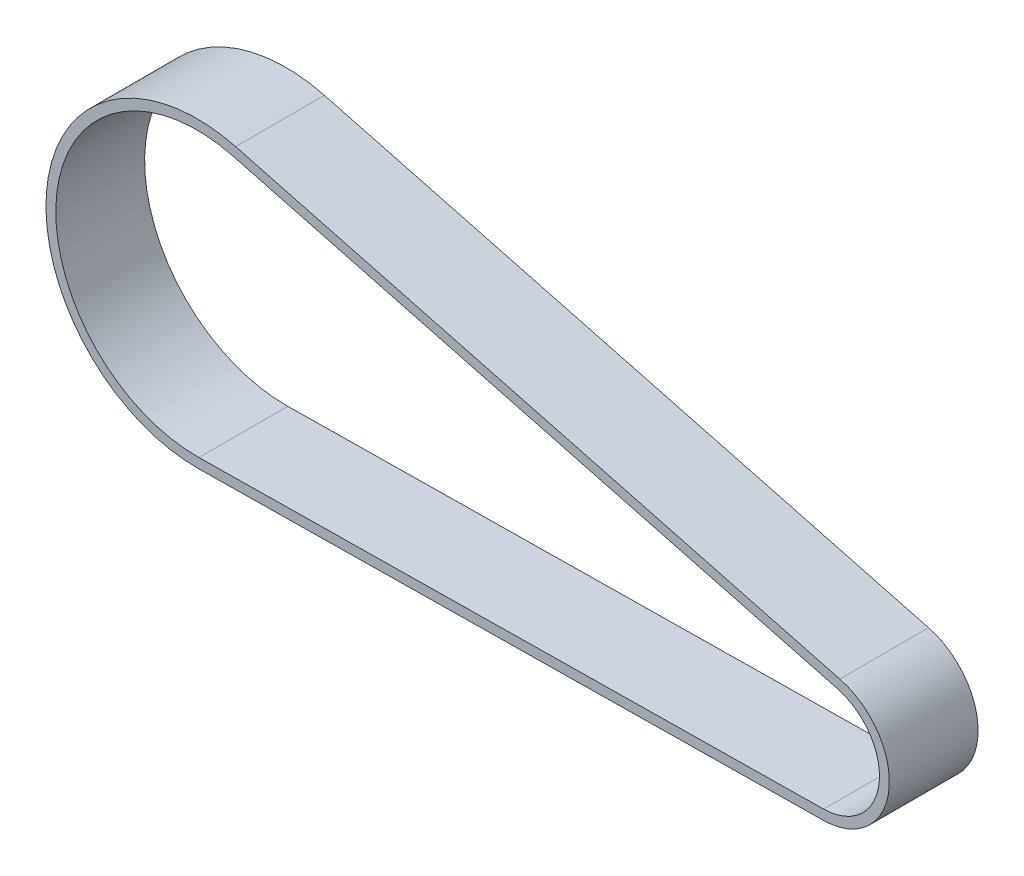
ISO-10303-21;
HEADER;
FILE_DESCRIPTION(('STEP AP214'),'2;1');
FILE_NAME('part.step','',(''),(''),'','','');
FILE_SCHEMA(('AUTOMOTIVE_DESIGN { 1 0 10303 214 1 1 1 1 }'));
ENDSEC;
DATA;
#1=APPLICATION_CONTEXT('core data for automotive mechanical design processes');
#2=APPLICATION_PROTOCOL_DEFINITION('international standard','automotive_design',2000,#1);
#3=PRODUCT_CONTEXT('',#1,'mechanical');
#4=PRODUCT('Part','Part','',(#3));
#5=PRODUCT_RELATED_PRODUCT_CATEGORY('part','',(#4));
#6=PRODUCT_DEFINITION_FORMATION('','',#4);
#7=PRODUCT_DEFINITION_CONTEXT('part definition',#1,'design');
#8=PRODUCT_DEFINITION('design','',#6,#7);
#9=PRODUCT_DEFINITION_SHAPE('','',#8);
#10=(LENGTH_UNIT() NAMED_UNIT(*) SI_UNIT(.MILLI.,.METRE.));
#11=(NAMED_UNIT(*) PLANE_ANGLE_UNIT() SI_UNIT($,.RADIAN.));
#12=(NAMED_UNIT(*) SI_UNIT($,.STERADIAN.) SOLID_ANGLE_UNIT());
#13=UNCERTAINTY_MEASURE_WITH_UNIT(LENGTH_MEASURE(1.E-05),#10,'distance_accuracy_value','');
#14=(GEOMETRIC_REPRESENTATION_CONTEXT(3) GLOBAL_UNCERTAINTY_ASSIGNED_CONTEXT((#13)) GLOBAL_UNIT_ASSIGNED_CONTEXT((#10,
#11,#12)) REPRESENTATION_CONTEXT('',''));
#15=CARTESIAN_POINT('',(0.,0.,0.));
#16=DIRECTION('',(0.,0.,1.));
#17=DIRECTION('',(1.,0.,0.));
#18=AXIS2_PLACEMENT_3D('',#15,#16,#17);
#19=CARTESIAN_POINT('',(0.,0.,-4.5));
#20=DIRECTION('',(0.,0.,1.));
#21=DIRECTION('',(1.,0.,0.));
#22=AXIS2_PLACEMENT_3D('',#19,#20,#21);
#23=CYLINDRICAL_SURFACE('',#22,6.73);
#24=DIRECTION('',(0.,0.,1.));
#25=VECTOR('',#24,1.);
#26=CARTESIAN_POINT('',(1.71271445503276,6.50841833286105,-4.5));
#27=LINE('',#26,#25);
#28=CARTESIAN_POINT('',(1.71271445503276,6.50841833286105,-4.5));
#29=VERTEX_POINT('',#28);
#30=CARTESIAN_POINT('',(1.71271445503276,6.50841833286105,4.5));
#31=VERTEX_POINT('',#30);
#32=EDGE_CURVE('E84',#29,#31,#27,.T.);
#33=ORIENTED_EDGE('',*,*,#32,.T.);
#34=CARTESIAN_POINT('',(0.,0.,4.5));
#35=DIRECTION('',(0.,0.,-1.));
#36=DIRECTION('',(-1.,0.,0.));
#37=AXIS2_PLACEMENT_3D('',#34,#35,#36);
#38=CIRCLE('',#37,6.73);
#39=CARTESIAN_POINT('',(0.0849420551690539,-6.72946393461349,4.5));
#40=VERTEX_POINT('',#39);
#41=EDGE_CURVE('E176',#40,#31,#38,.F.);
#42=ORIENTED_EDGE('',*,*,#41,.F.);
#43=DIRECTION('',(0.,0.,1.));
#44=VECTOR('',#43,1.);
#45=CARTESIAN_POINT('',(0.0849420551690539,-6.72946393461349,-4.5));
#46=LINE('',#45,#44);
#47=CARTESIAN_POINT('',(0.0849420551690539,-6.72946393461349,-4.5));
#48=VERTEX_POINT('',#47);
#49=EDGE_CURVE('E12',#48,#40,#46,.T.);
#50=ORIENTED_EDGE('',*,*,#49,.F.);
#51=CARTESIAN_POINT('',(0.,0.,-4.5));
#52=DIRECTION('',(0.,0.,-1.));
#53=DIRECTION('',(-1.,0.,0.));
#54=AXIS2_PLACEMENT_3D('',#51,#52,#53);
#55=CIRCLE('',#54,6.73);
#56=EDGE_CURVE('E195',#48,#29,#55,.F.);
#57=ORIENTED_EDGE('',*,*,#56,.T.);
#58=EDGE_LOOP('',(#33,#42,#50,#57));
#59=FACE_BOUND('',#58,.T.);
#60=ADVANCED_FACE('F81',(#59),#23,.T.);
#61=CARTESIAN_POINT('',(0.084942055169054,-6.72946393461349,-4.5));
#62=DIRECTION('',(0.012621404928537,-0.999920346896506,0.));
#63=DIRECTION('',(0.999920346896507,0.012621404928537,0.));
#64=AXIS2_PLACEMENT_3D('',#61,#62,#63);
#65=PLANE('',#64);
#66=ORIENTED_EDGE('',*,*,#49,.T.);
#67=DIRECTION('',(0.999920346896507,0.012621404928537,0.));
#68=VECTOR('',#67,1.);
#69=CARTESIAN_POINT('',(0.084942055169054,-6.72946393461349,4.5));
#70=LINE('',#69,#68);
#71=CARTESIAN_POINT('',(-63.2401251553675,-7.52877891792358,4.5));
#72=VERTEX_POINT('',#71);
#73=EDGE_CURVE('E185',#72,#40,#70,.T.);
#74=ORIENTED_EDGE('',*,*,#73,.F.);
#75=DIRECTION('',(0.,0.,1.));
#76=VECTOR('',#75,1.);
#77=CARTESIAN_POINT('',(-63.2401251553675,-7.52877891792358,-4.5));
#78=LINE('',#77,#76);
#79=CARTESIAN_POINT('',(-63.2401251553675,-7.52877891792358,-4.5));
#80=VERTEX_POINT('',#79);
#81=EDGE_CURVE('E89',#80,#72,#78,.T.);
#82=ORIENTED_EDGE('',*,*,#81,.F.);
#83=DIRECTION('',(0.999920346896507,0.012621404928537,0.));
#84=VECTOR('',#83,1.);
#85=CARTESIAN_POINT('',(0.084942055169054,-6.72946393461349,-4.5));
#86=LINE('',#85,#84);
#87=EDGE_CURVE('E206',#80,#48,#86,.T.);
#88=ORIENTED_EDGE('',*,*,#87,.T.);
#89=EDGE_LOOP('',(#66,#74,#82,#88));
#90=FACE_BOUND('',#89,.T.);
#91=ADVANCED_FACE('F218',(#90),#65,.T.);
#92=CARTESIAN_POINT('',(-63.433611292922,7.79999999999986,-4.5));
#93=DIRECTION('',(0.,0.,1.));
#94=DIRECTION('',(1.,0.,0.));
#95=AXIS2_PLACEMENT_3D('',#92,#93,#94);
#96=CYLINDRICAL_SURFACE('',#95,15.33);
#97=ORIENTED_EDGE('',*,*,#81,.T.);
#98=CARTESIAN_POINT('',(-63.433611292922,7.79999999999986,4.5));
#99=DIRECTION('',(0.,0.,-1.));
#100=DIRECTION('',(-1.,0.,0.));
#101=AXIS2_PLACEMENT_3D('',#98,#99,#100);
#102=CIRCLE('',#101,15.33);
#103=CARTESIAN_POINT('',(-59.5322869845041,22.6252679112569,4.5));
#104=VERTEX_POINT('',#103);
#105=EDGE_CURVE('E182',#104,#72,#102,.F.);
#106=ORIENTED_EDGE('',*,*,#105,.F.);
#107=DIRECTION('',(0.,0.,1.));
#108=VECTOR('',#107,1.);
#109=CARTESIAN_POINT('',(-59.5322869845041,22.6252679112569,-4.5));
#110=LINE('',#109,#108);
#111=CARTESIAN_POINT('',(-59.5322869845041,22.6252679112569,-4.5));
#112=VERTEX_POINT('',#111);
#113=EDGE_CURVE('E209',#112,#104,#110,.T.);
#114=ORIENTED_EDGE('',*,*,#113,.F.);
#115=CARTESIAN_POINT('',(-63.433611292922,7.79999999999986,-4.5));
#116=DIRECTION('',(0.,0.,-1.));
#117=DIRECTION('',(-1.,0.,0.));
#118=AXIS2_PLACEMENT_3D('',#115,#116,#117);
#119=CIRCLE('',#118,15.33);
#120=EDGE_CURVE('E203',#112,#80,#119,.F.);
#121=ORIENTED_EDGE('',*,*,#120,.T.);
#122=EDGE_LOOP('',(#97,#106,#114,#121));
#123=FACE_BOUND('',#122,.T.);
#124=ADVANCED_FACE('F224',(#123),#96,.T.);
#125=CARTESIAN_POINT('',(1.71271445503274,6.50841833286106,-4.5));
#126=DIRECTION('',(0.254489517835474,0.967075532371628,0.));
#127=DIRECTION('',(-0.967075532371628,0.254489517835474,0.));
#128=AXIS2_PLACEMENT_3D('',#125,#126,#127);
#129=PLANE('',#128);
#130=ORIENTED_EDGE('',*,*,#113,.T.);
#131=DIRECTION('',(-0.967075532371628,0.254489517835474,0.));
#132=VECTOR('',#131,1.);
#133=CARTESIAN_POINT('',(1.71271445503274,6.50841833286106,4.5));
#134=LINE('',#133,#132);
#135=EDGE_CURVE('E179',#31,#104,#134,.T.);
#136=ORIENTED_EDGE('',*,*,#135,.F.);
#137=ORIENTED_EDGE('',*,*,#32,.F.);
#138=DIRECTION('',(-0.967075532371628,0.254489517835474,0.));
#139=VECTOR('',#138,1.);
#140=CARTESIAN_POINT('',(1.71271445503274,6.50841833286106,-4.5));
#141=LINE('',#140,#139);
#142=EDGE_CURVE('E200',#29,#112,#141,.T.);
#143=ORIENTED_EDGE('',*,*,#142,.T.);
#144=EDGE_LOOP('',(#130,#136,#137,#143));
#145=FACE_BOUND('',#144,.T.);
#146=ADVANCED_FACE('F213',(#145),#129,.T.);
#147=CARTESIAN_POINT('',(0.,0.,-4.5));
#148=DIRECTION('',(0.,0.,-1.));
#149=DIRECTION('',(-1.,0.,0.));
#150=AXIS2_PLACEMENT_3D('',#147,#148,#149);
#151=PLANE('',#150);
#152=CARTESIAN_POINT('',(0.,0.,-4.5));
#153=DIRECTION('',(0.,0.,1.));
#154=DIRECTION('',(-1.,0.,0.));
#155=AXIS2_PLACEMENT_3D('',#152,#153,#154);
#156=CIRCLE('',#155,5.73);
#157=CARTESIAN_POINT('',(0.0723206502405169,-5.72954358771698,-4.5));
#158=VERTEX_POINT('',#157);
#159=CARTESIAN_POINT('',(1.45822493719726,5.54134280048943,-4.5));
#160=VERTEX_POINT('',#159);
#161=EDGE_CURVE('E188',#158,#160,#156,.T.);
#162=ORIENTED_EDGE('',*,*,#161,.T.);
#163=DIRECTION('',(-0.967075532371628,0.254489517835474,0.));
#164=VECTOR('',#163,1.);
#165=CARTESIAN_POINT('',(-59.7867765023396,21.6581923788853,-4.5));
#166=LINE('',#165,#164);
#167=CARTESIAN_POINT('',(-59.7867765023396,21.6581923788853,-4.5));
#168=VERTEX_POINT('',#167);
#169=EDGE_CURVE('E153',#160,#168,#166,.T.);
#170=ORIENTED_EDGE('',*,*,#169,.T.);
#171=CARTESIAN_POINT('',(-63.433611292922,7.79999999999986,-4.5));
#172=DIRECTION('',(0.,0.,1.));
#173=DIRECTION('',(-1.,0.,0.));
#174=AXIS2_PLACEMENT_3D('',#171,#172,#173);
#175=CIRCLE('',#174,14.33);
#176=CARTESIAN_POINT('',(-63.252746560296,-6.52885857102708,-4.5));
#177=VERTEX_POINT('',#176);
#178=EDGE_CURVE('E97',#168,#177,#175,.T.);
#179=ORIENTED_EDGE('',*,*,#178,.T.);
#180=DIRECTION('',(0.999920346896506,0.012621404928537,0.));
#181=VECTOR('',#180,1.);
#182=CARTESIAN_POINT('',(0.0723206502405169,-5.72954358771698,-4.5));
#183=LINE('',#182,#181);
#184=EDGE_CURVE('E158',#177,#158,#183,.T.);
#185=ORIENTED_EDGE('',*,*,#184,.T.);
#186=EDGE_LOOP('',(#162,#170,#179,#185));
#187=FACE_BOUND('',#186,.T.);
#188=ORIENTED_EDGE('',*,*,#56,.F.);
#189=ORIENTED_EDGE('',*,*,#87,.F.);
#190=ORIENTED_EDGE('',*,*,#120,.F.);
#191=ORIENTED_EDGE('',*,*,#142,.F.);
#192=EDGE_LOOP('',(#188,#189,#190,#191));
#193=FACE_BOUND('',#192,.T.);
#194=ADVANCED_FACE('F222',(#187,#193),#151,.T.);
#195=CARTESIAN_POINT('',(0.,0.,-4.5));
#196=DIRECTION('',(0.,0.,1.));
#197=DIRECTION('',(1.,0.,0.));
#198=AXIS2_PLACEMENT_3D('',#195,#196,#197);
#199=CYLINDRICAL_SURFACE('',#198,5.73);
#200=DIRECTION('',(0.,0.,1.));
#201=VECTOR('',#200,1.);
#202=CARTESIAN_POINT('',(0.0723206502405169,-5.72954358771698,-4.5));
#203=LINE('',#202,#201);
#204=CARTESIAN_POINT('',(0.0723206502405169,-5.72954358771698,4.5));
#205=VERTEX_POINT('',#204);
#206=EDGE_CURVE('E163',#158,#205,#203,.T.);
#207=ORIENTED_EDGE('',*,*,#206,.T.);
#208=CARTESIAN_POINT('',(0.,0.,4.5));
#209=DIRECTION('',(0.,0.,1.));
#210=DIRECTION('',(-1.,0.,0.));
#211=AXIS2_PLACEMENT_3D('',#208,#209,#210);
#212=CIRCLE('',#211,5.73);
#213=CARTESIAN_POINT('',(1.45822493719726,5.54134280048943,4.5));
#214=VERTEX_POINT('',#213);
#215=EDGE_CURVE('E161',#205,#214,#212,.T.);
#216=ORIENTED_EDGE('',*,*,#215,.T.);
#217=DIRECTION('',(0.,0.,1.));
#218=VECTOR('',#217,1.);
#219=CARTESIAN_POINT('',(1.45822493719726,5.54134280048943,-4.5));
#220=LINE('',#219,#218);
#221=EDGE_CURVE('E146',#160,#214,#220,.T.);
#222=ORIENTED_EDGE('',*,*,#221,.F.);
#223=ORIENTED_EDGE('',*,*,#161,.F.);
#224=EDGE_LOOP('',(#207,#216,#222,#223));
#225=FACE_BOUND('',#224,.T.);
#226=ADVANCED_FACE('F162',(#225),#199,.F.);
#227=CARTESIAN_POINT('',(0.0723206502405169,-5.72954358771698,-4.5));
#228=DIRECTION('',(0.012621404928537,-0.999920346896507,0.));
#229=DIRECTION('',(0.999920346896506,0.012621404928537,0.));
#230=AXIS2_PLACEMENT_3D('',#227,#228,#229);
#231=PLANE('',#230);
#232=DIRECTION('',(0.,0.,1.));
#233=VECTOR('',#232,1.);
#234=CARTESIAN_POINT('',(-63.252746560296,-6.52885857102708,-4.5));
#235=LINE('',#234,#233);
#236=CARTESIAN_POINT('',(-63.252746560296,-6.52885857102708,4.5));
#237=VERTEX_POINT('',#236);
#238=EDGE_CURVE('E196',#177,#237,#235,.T.);
#239=ORIENTED_EDGE('',*,*,#238,.T.);
#240=DIRECTION('',(0.999920346896506,0.012621404928537,0.));
#241=VECTOR('',#240,1.);
#242=CARTESIAN_POINT('',(0.0723206502405169,-5.72954358771698,4.5));
#243=LINE('',#242,#241);
#244=EDGE_CURVE('E172',#237,#205,#243,.T.);
#245=ORIENTED_EDGE('',*,*,#244,.T.);
#246=ORIENTED_EDGE('',*,*,#206,.F.);
#247=ORIENTED_EDGE('',*,*,#184,.F.);
#248=EDGE_LOOP('',(#239,#245,#246,#247));
#249=FACE_BOUND('',#248,.T.);
#250=ADVANCED_FACE('F267',(#249),#231,.F.);
#251=CARTESIAN_POINT('',(-63.433611292922,7.79999999999986,-4.5));
#252=DIRECTION('',(0.,0.,1.));
#253=DIRECTION('',(1.,0.,0.));
#254=AXIS2_PLACEMENT_3D('',#251,#252,#253);
#255=CYLINDRICAL_SURFACE('',#254,14.33);
#256=DIRECTION('',(0.,0.,1.));
#257=VECTOR('',#256,1.);
#258=CARTESIAN_POINT('',(-59.7867765023396,21.6581923788853,-4.5));
#259=LINE('',#258,#257);
#260=CARTESIAN_POINT('',(-59.7867765023396,21.6581923788853,4.5));
#261=VERTEX_POINT('',#260);
#262=EDGE_CURVE('E157',#168,#261,#259,.T.);
#263=ORIENTED_EDGE('',*,*,#262,.T.);
#264=CARTESIAN_POINT('',(-63.433611292922,7.79999999999986,4.5));
#265=DIRECTION('',(0.,0.,1.));
#266=DIRECTION('',(-1.,0.,0.));
#267=AXIS2_PLACEMENT_3D('',#264,#265,#266);
#268=CIRCLE('',#267,14.33);
#269=EDGE_CURVE('E170',#261,#237,#268,.T.);
#270=ORIENTED_EDGE('',*,*,#269,.T.);
#271=ORIENTED_EDGE('',*,*,#238,.F.);
#272=ORIENTED_EDGE('',*,*,#178,.F.);
#273=EDGE_LOOP('',(#263,#270,#271,#272));
#274=FACE_BOUND('',#273,.T.);
#275=ADVANCED_FACE('F276',(#274),#255,.F.);
#276=CARTESIAN_POINT('',(-59.7867765023396,21.6581923788853,-4.5));
#277=DIRECTION('',(0.254489517835474,0.967075532371628,0.));
#278=DIRECTION('',(-0.967075532371628,0.254489517835474,0.));
#279=AXIS2_PLACEMENT_3D('',#276,#277,#278);
#280=PLANE('',#279);
#281=ORIENTED_EDGE('',*,*,#221,.T.);
#282=DIRECTION('',(-0.967075532371628,0.254489517835474,0.));
#283=VECTOR('',#282,1.);
#284=CARTESIAN_POINT('',(-59.7867765023396,21.6581923788853,4.5));
#285=LINE('',#284,#283);
#286=EDGE_CURVE('E150',#214,#261,#285,.T.);
#287=ORIENTED_EDGE('',*,*,#286,.T.);
#288=ORIENTED_EDGE('',*,*,#262,.F.);
#289=ORIENTED_EDGE('',*,*,#169,.F.);
#290=EDGE_LOOP('',(#281,#287,#288,#289));
#291=FACE_BOUND('',#290,.T.);
#292=ADVANCED_FACE('F148',(#291),#280,.F.);
#293=CARTESIAN_POINT('',(0.,0.,4.5));
#294=DIRECTION('',(0.,0.,-1.));
#295=DIRECTION('',(-1.,0.,0.));
#296=AXIS2_PLACEMENT_3D('',#293,#294,#295);
#297=PLANE('',#296);
#298=ORIENTED_EDGE('',*,*,#41,.T.);
#299=ORIENTED_EDGE('',*,*,#135,.T.);
#300=ORIENTED_EDGE('',*,*,#105,.T.);
#301=ORIENTED_EDGE('',*,*,#73,.T.);
#302=EDGE_LOOP('',(#298,#299,#300,#301));
#303=FACE_BOUND('',#302,.T.);
#304=ORIENTED_EDGE('',*,*,#215,.F.);
#305=ORIENTED_EDGE('',*,*,#244,.F.);
#306=ORIENTED_EDGE('',*,*,#269,.F.);
#307=ORIENTED_EDGE('',*,*,#286,.F.);
#308=EDGE_LOOP('',(#304,#305,#306,#307));
#309=FACE_BOUND('',#308,.T.);
#310=ADVANCED_FACE('F168',(#303,#309),#297,.F.);
#311=CLOSED_SHELL('',(#60,#91,#124,#146,#194,#226,#250,#275,#292,#310));
#312=MANIFOLD_SOLID_BREP('B2',#311);
#313=ADVANCED_BREP_SHAPE_REPRESENTATION('',(#18,#312),#14);
#314=SHAPE_DEFINITION_REPRESENTATION(#9,#313);
ENDSEC;
END-ISO-10303-21;
